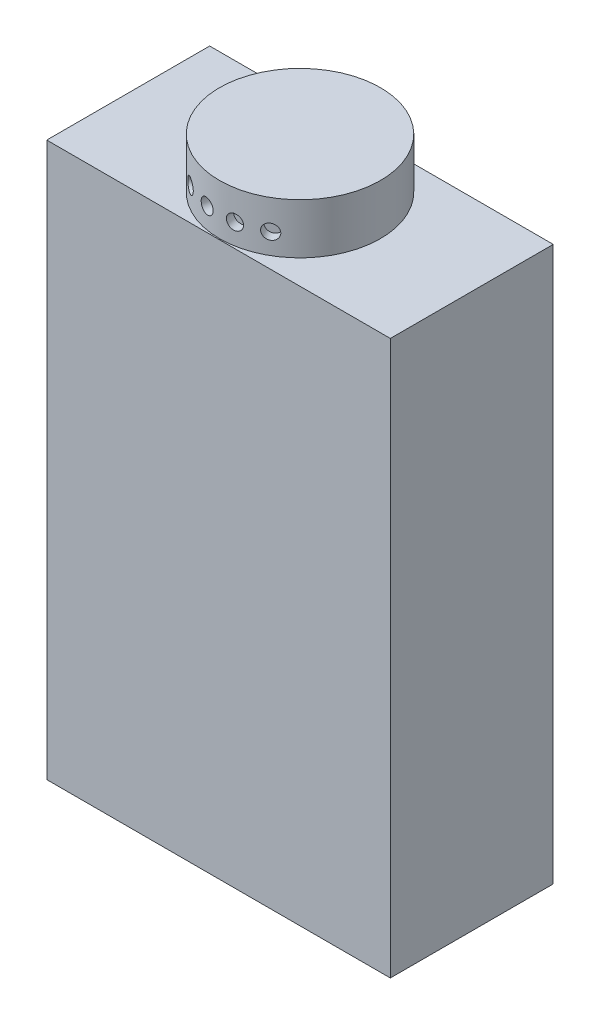
ISO-10303-21;
HEADER;
FILE_DESCRIPTION(('STEP AP214'),'2;1');
FILE_NAME('part.step','',(''),(''),'','','');
FILE_SCHEMA(('AUTOMOTIVE_DESIGN { 1 0 10303 214 1 1 1 1 }'));
ENDSEC;
DATA;
#1=APPLICATION_CONTEXT('core data for automotive mechanical design processes');
#2=APPLICATION_PROTOCOL_DEFINITION('international standard','automotive_design',2000,#1);
#3=PRODUCT_CONTEXT('',#1,'mechanical');
#4=PRODUCT('Part','Part','',(#3));
#5=PRODUCT_RELATED_PRODUCT_CATEGORY('part','',(#4));
#6=PRODUCT_DEFINITION_FORMATION('','',#4);
#7=PRODUCT_DEFINITION_CONTEXT('part definition',#1,'design');
#8=PRODUCT_DEFINITION('design','',#6,#7);
#9=PRODUCT_DEFINITION_SHAPE('','',#8);
#10=(LENGTH_UNIT() NAMED_UNIT(*) SI_UNIT(.MILLI.,.METRE.));
#11=(NAMED_UNIT(*) PLANE_ANGLE_UNIT() SI_UNIT($,.RADIAN.));
#12=(NAMED_UNIT(*) SI_UNIT($,.STERADIAN.) SOLID_ANGLE_UNIT());
#13=UNCERTAINTY_MEASURE_WITH_UNIT(LENGTH_MEASURE(1.E-05),#10,'distance_accuracy_value','');
#14=(GEOMETRIC_REPRESENTATION_CONTEXT(3) GLOBAL_UNCERTAINTY_ASSIGNED_CONTEXT((#13)) GLOBAL_UNIT_ASSIGNED_CONTEXT((#10,
#11,#12)) REPRESENTATION_CONTEXT('',''));
#15=CARTESIAN_POINT('',(0.,0.,0.));
#16=DIRECTION('',(0.,0.,1.));
#17=DIRECTION('',(1.,0.,0.));
#18=AXIS2_PLACEMENT_3D('',#15,#16,#17);
#19=CARTESIAN_POINT('',(58.,187.,27.5));
#20=DIRECTION('',(0.,1.,0.));
#21=DIRECTION('',(0.,0.,1.));
#22=AXIS2_PLACEMENT_3D('',#19,#20,#21);
#23=PLANE('',#22);
#24=DIRECTION('',(0.,0.,-1.));
#25=VECTOR('',#24,1.);
#26=CARTESIAN_POINT('',(58.,187.,-27.5));
#27=LINE('',#26,#25);
#28=CARTESIAN_POINT('',(58.,187.,27.5));
#29=VERTEX_POINT('',#28);
#30=CARTESIAN_POINT('',(58.,187.,-27.5));
#31=VERTEX_POINT('',#30);
#32=EDGE_CURVE('E91',#29,#31,#27,.T.);
#33=ORIENTED_EDGE('',*,*,#32,.T.);
#34=DIRECTION('',(-1.,0.,0.));
#35=VECTOR('',#34,1.);
#36=CARTESIAN_POINT('',(-58.,187.,-27.5));
#37=LINE('',#36,#35);
#38=CARTESIAN_POINT('',(-58.,187.,-27.5));
#39=VERTEX_POINT('',#38);
#40=EDGE_CURVE('E86',#31,#39,#37,.T.);
#41=ORIENTED_EDGE('',*,*,#40,.T.);
#42=DIRECTION('',(0.,0.,1.));
#43=VECTOR('',#42,1.);
#44=CARTESIAN_POINT('',(-58.,187.,-27.5));
#45=LINE('',#44,#43);
#46=CARTESIAN_POINT('',(-58.,187.,27.5));
#47=VERTEX_POINT('',#46);
#48=EDGE_CURVE('E89',#39,#47,#45,.T.);
#49=ORIENTED_EDGE('',*,*,#48,.T.);
#50=DIRECTION('',(1.,0.,0.));
#51=VECTOR('',#50,1.);
#52=CARTESIAN_POINT('',(-58.,187.,27.5));
#53=LINE('',#52,#51);
#54=EDGE_CURVE('E56',#47,#29,#53,.T.);
#55=ORIENTED_EDGE('',*,*,#54,.T.);
#56=EDGE_LOOP('',(#33,#41,#49,#55));
#57=FACE_BOUND('',#56,.T.);
#58=CARTESIAN_POINT('',(0.,187.,0.));
#59=DIRECTION('',(0.,1.,0.));
#60=DIRECTION('',(0.,0.,1.));
#61=AXIS2_PLACEMENT_3D('',#58,#59,#60);
#62=CIRCLE('',#61,27.1639746488095);
#63=CARTESIAN_POINT('',(0.,187.,27.1639746488095));
#64=VERTEX_POINT('',#63);
#65=EDGE_CURVE('E118',#64,#64,#62,.T.);
#66=ORIENTED_EDGE('',*,*,#65,.F.);
#67=EDGE_LOOP('',(#66));
#68=FACE_BOUND('',#67,.T.);
#69=ADVANCED_FACE('F34',(#57,#68),#23,.T.);
#70=CARTESIAN_POINT('',(58.,187.,-27.5));
#71=DIRECTION('',(-1.,0.,0.));
#72=DIRECTION('',(0.,0.,1.));
#73=AXIS2_PLACEMENT_3D('',#70,#71,#72);
#74=PLANE('',#73);
#75=DIRECTION('',(0.,0.,-1.));
#76=VECTOR('',#75,1.);
#77=CARTESIAN_POINT('',(58.,0.,-27.5));
#78=LINE('',#77,#76);
#79=CARTESIAN_POINT('',(58.,0.,27.5));
#80=VERTEX_POINT('',#79);
#81=CARTESIAN_POINT('',(58.,0.,-27.5));
#82=VERTEX_POINT('',#81);
#83=EDGE_CURVE('E104',#80,#82,#78,.T.);
#84=ORIENTED_EDGE('',*,*,#83,.T.);
#85=DIRECTION('',(0.,-1.,0.));
#86=VECTOR('',#85,1.);
#87=CARTESIAN_POINT('',(58.,187.,-27.5));
#88=LINE('',#87,#86);
#89=EDGE_CURVE('E11',#31,#82,#88,.T.);
#90=ORIENTED_EDGE('',*,*,#89,.F.);
#91=ORIENTED_EDGE('',*,*,#32,.F.);
#92=DIRECTION('',(0.,-1.,0.));
#93=VECTOR('',#92,1.);
#94=CARTESIAN_POINT('',(58.,187.,27.5));
#95=LINE('',#94,#93);
#96=EDGE_CURVE('E100',#29,#80,#95,.T.);
#97=ORIENTED_EDGE('',*,*,#96,.T.);
#98=EDGE_LOOP('',(#84,#90,#91,#97));
#99=FACE_BOUND('',#98,.T.);
#100=ADVANCED_FACE('F36',(#99),#74,.F.);
#101=CARTESIAN_POINT('',(-58.,187.,-27.5));
#102=DIRECTION('',(0.,0.,1.));
#103=DIRECTION('',(1.,0.,0.));
#104=AXIS2_PLACEMENT_3D('',#101,#102,#103);
#105=PLANE('',#104);
#106=DIRECTION('',(-1.,0.,0.));
#107=VECTOR('',#106,1.);
#108=CARTESIAN_POINT('',(-58.,0.,-27.5));
#109=LINE('',#108,#107);
#110=CARTESIAN_POINT('',(-58.,0.,-27.5));
#111=VERTEX_POINT('',#110);
#112=EDGE_CURVE('E95',#82,#111,#109,.T.);
#113=ORIENTED_EDGE('',*,*,#112,.T.);
#114=DIRECTION('',(0.,-1.,0.));
#115=VECTOR('',#114,1.);
#116=CARTESIAN_POINT('',(-58.,187.,-27.5));
#117=LINE('',#116,#115);
#118=EDGE_CURVE('E48',#39,#111,#117,.T.);
#119=ORIENTED_EDGE('',*,*,#118,.F.);
#120=ORIENTED_EDGE('',*,*,#40,.F.);
#121=ORIENTED_EDGE('',*,*,#89,.T.);
#122=EDGE_LOOP('',(#113,#119,#120,#121));
#123=FACE_BOUND('',#122,.T.);
#124=ADVANCED_FACE('F94',(#123),#105,.F.);
#125=CARTESIAN_POINT('',(-58.,187.,-27.5));
#126=DIRECTION('',(1.,0.,0.));
#127=DIRECTION('',(0.,0.,-1.));
#128=AXIS2_PLACEMENT_3D('',#125,#126,#127);
#129=PLANE('',#128);
#130=DIRECTION('',(0.,0.,1.));
#131=VECTOR('',#130,1.);
#132=CARTESIAN_POINT('',(-58.,0.,-27.5));
#133=LINE('',#132,#131);
#134=CARTESIAN_POINT('',(-58.,0.,27.5));
#135=VERTEX_POINT('',#134);
#136=EDGE_CURVE('E73',#111,#135,#133,.T.);
#137=ORIENTED_EDGE('',*,*,#136,.T.);
#138=DIRECTION('',(0.,-1.,0.));
#139=VECTOR('',#138,1.);
#140=CARTESIAN_POINT('',(-58.,187.,27.5));
#141=LINE('',#140,#139);
#142=EDGE_CURVE('E96',#47,#135,#141,.T.);
#143=ORIENTED_EDGE('',*,*,#142,.F.);
#144=ORIENTED_EDGE('',*,*,#48,.F.);
#145=ORIENTED_EDGE('',*,*,#118,.T.);
#146=EDGE_LOOP('',(#137,#143,#144,#145));
#147=FACE_BOUND('',#146,.T.);
#148=ADVANCED_FACE('F98',(#147),#129,.F.);
#149=CARTESIAN_POINT('',(-58.,187.,27.5));
#150=DIRECTION('',(0.,0.,-1.));
#151=DIRECTION('',(-1.,0.,0.));
#152=AXIS2_PLACEMENT_3D('',#149,#150,#151);
#153=PLANE('',#152);
#154=DIRECTION('',(1.,0.,0.));
#155=VECTOR('',#154,1.);
#156=CARTESIAN_POINT('',(-58.,0.,27.5));
#157=LINE('',#156,#155);
#158=EDGE_CURVE('E79',#135,#80,#157,.T.);
#159=ORIENTED_EDGE('',*,*,#158,.T.);
#160=ORIENTED_EDGE('',*,*,#96,.F.);
#161=ORIENTED_EDGE('',*,*,#54,.F.);
#162=ORIENTED_EDGE('',*,*,#142,.T.);
#163=EDGE_LOOP('',(#159,#160,#161,#162));
#164=FACE_BOUND('',#163,.T.);
#165=ADVANCED_FACE('F112',(#164),#153,.F.);
#166=CARTESIAN_POINT('',(58.,0.,27.5));
#167=DIRECTION('',(0.,1.,0.));
#168=DIRECTION('',(0.,0.,1.));
#169=AXIS2_PLACEMENT_3D('',#166,#167,#168);
#170=PLANE('',#169);
#171=ORIENTED_EDGE('',*,*,#83,.F.);
#172=ORIENTED_EDGE('',*,*,#158,.F.);
#173=ORIENTED_EDGE('',*,*,#136,.F.);
#174=ORIENTED_EDGE('',*,*,#112,.F.);
#175=EDGE_LOOP('',(#171,#172,#173,#174));
#176=FACE_BOUND('',#175,.T.);
#177=ADVANCED_FACE('F115',(#176),#170,.F.);
#178=CARTESIAN_POINT('',(0.,204.,0.));
#179=DIRECTION('',(0.,-1.,0.));
#180=DIRECTION('',(0.,0.,-1.));
#181=AXIS2_PLACEMENT_3D('',#178,#179,#180);
#182=CYLINDRICAL_SURFACE('',#181,27.1639746488095);
#183=CARTESIAN_POINT('',(-15.6894074743378,194.,22.1748508862035));
#184=CARTESIAN_POINT('',(-15.6894029550685,194.140106679944,22.1748552497607));
#185=CARTESIAN_POINT('',(-15.6797233104639,194.280307372974,22.1817125712672));
#186=CARTESIAN_POINT('',(-15.6412082986541,194.55682562425,22.2088868633514));
#187=CARTESIAN_POINT('',(-15.6123515233179,194.693138665006,22.2292188761488));
#188=CARTESIAN_POINT('',(-15.5361917214486,194.957836922639,22.2825136067384));
#189=CARTESIAN_POINT('',(-15.4888995146054,195.086226738526,22.3154689157656));
#190=CARTESIAN_POINT('',(-15.3770253854371,195.331514670671,22.3927043298646));
#191=CARTESIAN_POINT('',(-15.312447028161,195.448415149669,22.4369820997387));
#192=CARTESIAN_POINT('',(-15.1673632323357,195.667797704017,22.5353120523544));
#193=CARTESIAN_POINT('',(-15.0868144178466,195.770239181979,22.5893908195667));
#194=CARTESIAN_POINT('',(-14.9118873967137,195.957446593354,22.7052442307431));
#195=CARTESIAN_POINT('',(-14.817508572057,196.042211736464,22.7670192186049));
#196=CARTESIAN_POINT('',(-14.6171283072616,196.191798299131,22.8961850780134));
#197=CARTESIAN_POINT('',(-14.5111065857751,196.256584143773,22.963585698529));
#198=CARTESIAN_POINT('',(-14.2903522098092,196.3641455156,23.1016077357295));
#199=CARTESIAN_POINT('',(-14.1756197377129,196.406921503474,23.1722290849674));
#200=CARTESIAN_POINT('',(-13.9408891048282,196.469130815425,23.3141991022032));
#201=CARTESIAN_POINT('',(-13.8209069008981,196.488630387828,23.3855451203361));
#202=CARTESIAN_POINT('',(-13.5787215503573,196.503938238329,23.5269951606814));
#203=CARTESIAN_POINT('',(-13.4565184532482,196.499747043826,23.5970992105075));
#204=CARTESIAN_POINT('',(-13.2137682158334,196.467846309794,23.7338830739325));
#205=CARTESIAN_POINT('',(-13.0932171822919,196.440208008169,23.8005726115568));
#206=CARTESIAN_POINT('',(-12.8569095216933,196.362308483955,23.9290513020504));
#207=CARTESIAN_POINT('',(-12.7411529486769,196.312047006443,23.9908403996916));
#208=CARTESIAN_POINT('',(-12.5177027469731,196.190249116235,24.1081854108323));
#209=CARTESIAN_POINT('',(-12.4100214392579,196.118680989369,24.1637318613998));
#210=CARTESIAN_POINT('',(-12.206164654272,195.956324383044,24.2673475928422));
#211=CARTESIAN_POINT('',(-12.1099894625014,195.865535426815,24.3154166881912));
#212=CARTESIAN_POINT('',(-11.9317707932792,195.666913252932,24.4033665375198));
#213=CARTESIAN_POINT('',(-11.8497810241799,195.559018099299,24.4432162764935));
#214=CARTESIAN_POINT('',(-11.7029613396554,195.329461568824,24.5138506500069));
#215=CARTESIAN_POINT('',(-11.6381314433124,195.207800176674,24.5446352744658));
#216=CARTESIAN_POINT('',(-11.5277166565527,194.954119086872,24.5966870185393));
#217=CARTESIAN_POINT('',(-11.4821349319311,194.822097689516,24.6179525725628));
#218=CARTESIAN_POINT('',(-11.4117393742543,194.55146635191,24.6506641541966));
#219=CARTESIAN_POINT('',(-11.3869250070077,194.412856581228,24.6621104343848));
#220=CARTESIAN_POINT('',(-11.3589469718092,194.133526706341,24.6750092907956));
#221=CARTESIAN_POINT('',(-11.3557043237229,193.992816193052,24.6764983234078));
#222=CARTESIAN_POINT('',(-11.370768631088,193.712801725735,24.669560302936));
#223=CARTESIAN_POINT('',(-11.3890753406109,193.573497755673,24.6611333630163));
#224=CARTESIAN_POINT('',(-11.4465742486166,193.30050129748,24.6344971002037));
#225=CARTESIAN_POINT('',(-11.4857294602349,193.166799322688,24.6163051008235));
#226=CARTESIAN_POINT('',(-11.5836154567347,192.908507788182,24.5703943209817));
#227=CARTESIAN_POINT('',(-11.6423466231619,192.783918406135,24.5426753548342));
#228=CARTESIAN_POINT('',(-11.7776899426034,192.54699306006,24.4780137678918));
#229=CARTESIAN_POINT('',(-11.8543533034462,192.434693565491,24.4410447107215));
#230=CARTESIAN_POINT('',(-12.0230424262827,192.225904971768,24.3585049599857));
#231=CARTESIAN_POINT('',(-12.1150685103831,192.129416204197,24.3129340860653));
#232=CARTESIAN_POINT('',(-12.3119315561214,191.954690816514,24.2138393756627));
#233=CARTESIAN_POINT('',(-12.4168066251542,191.876510594316,24.1602917753055));
#234=CARTESIAN_POINT('',(-12.6359311827317,191.741009073244,24.0464131859454));
#235=CARTESIAN_POINT('',(-12.7501805600529,191.683687526931,23.9860822774215));
#236=CARTESIAN_POINT('',(-12.9844288683476,191.591626716436,23.8600873972671));
#237=CARTESIAN_POINT('',(-13.1044187207573,191.556852983014,23.7944317393884));
#238=CARTESIAN_POINT('',(-13.3467570301701,191.510762319505,23.6593497356381));
#239=CARTESIAN_POINT('',(-13.4691054316638,191.499444838044,23.5899234784393));
#240=CARTESIAN_POINT('',(-13.7121630278396,191.500595020854,23.449471926624));
#241=CARTESIAN_POINT('',(-13.8328766086472,191.512974963781,23.3784534874156));
#242=CARTESIAN_POINT('',(-14.0697426223581,191.560985136124,23.2366719005423));
#243=CARTESIAN_POINT('',(-14.1858950502762,191.596615390952,23.1659087531565));
#244=CARTESIAN_POINT('',(-14.410477978458,191.690091447462,23.0268777452071));
#245=CARTESIAN_POINT('',(-14.5189092021677,191.747935164576,22.9586096511594));
#246=CARTESIAN_POINT('',(-14.7252247178375,191.884186543593,22.8268324255793));
#247=CARTESIAN_POINT('',(-14.8231091238058,191.962593983177,22.7633232426067));
#248=CARTESIAN_POINT('',(-15.0061819349326,192.138076497126,22.6430581384714));
#249=CARTESIAN_POINT('',(-15.0913241145483,192.235216746818,22.5863269493437));
#250=CARTESIAN_POINT('',(-15.2463998957924,192.445283258154,22.4819387902088));
#251=CARTESIAN_POINT('',(-15.3163298266146,192.558213319198,22.4342840107379));
#252=CARTESIAN_POINT('',(-15.4393784717859,192.796919898152,22.3497810354003));
#253=CARTESIAN_POINT('',(-15.4924597954822,192.922724180389,22.3129568881142));
#254=CARTESIAN_POINT('',(-15.5802565800934,193.183323685357,22.2517418321618));
#255=CARTESIAN_POINT('',(-15.6149929573231,193.318108470402,22.2273367648246));
#256=CARTESIAN_POINT('',(-15.6565236988368,193.544727263779,22.1980891053294));
#257=CARTESIAN_POINT('',(-15.6688407826757,193.635107968525,22.1893904836404));
#258=CARTESIAN_POINT('',(-15.6852841326434,193.81697907676,22.1777699586016));
#259=CARTESIAN_POINT('',(-15.6894104267386,193.908469476459,22.174848035528));
#260=CARTESIAN_POINT('',(-15.6894074743378,194.,22.1748508862035));
#261=B_SPLINE_CURVE_WITH_KNOTS('',3,(#183,#184,#185,#186,#187,#188,#189,#190,#191,#192,#193,
#194,#195,#196,#197,#198,#199,#200,#201,#202,#203,#204,#205,#206,#207,#208,#209,#210,#211,#212,
#213,#214,#215,#216,#217,#218,#219,#220,#221,#222,#223,#224,#225,#226,#227,#228,#229,#230,#231,
#232,#233,#234,#235,#236,#237,#238,#239,#240,#241,#242,#243,#244,#245,#246,#247,#248,#249,#250,
#251,#252,#253,#254,#255,#256,#257,#258,#259,#260),.UNSPECIFIED.,.T.,.F.,(4,2,2,2,2,2,2,2,2,2,2,
2,2,2,2,2,2,2,2,2,2,2,2,2,2,2,2,2,2,2,2,2,2,2,2,2,2,2,4),(0.,0.419985816117514,
0.840441267072524,1.2606503248227,1.68077278647306,2.10205233428176,2.52335071328604,
2.94539497694104,3.3674304063887,3.78826177083129,4.20908376684071,4.62863176537844,
5.04818449156041,5.46836485576642,5.88855564369877,6.31030409197152,6.73205300923913,
7.15387126562081,7.57567867138784,7.99594086752037,8.41619826752923,8.83571257028185,
9.25523505006724,9.67597048328867,10.0967147390801,10.5187384968377,10.9407572481225,
11.3621293212808,11.783491489359,12.2032969064921,12.6231027824565,13.0428692723797,
13.4626312242855,13.8838808593904,14.3052320320604,14.7275118390617,15.1493091311115,
15.4236832929897,15.6980565180519),.UNSPECIFIED.);
#262=CARTESIAN_POINT('',(-15.6894074743378,194.,22.1748508862035));
#263=VERTEX_POINT('',#262);
#264=EDGE_CURVE('E163',#263,#263,#261,.T.);
#265=ORIENTED_EDGE('',*,*,#264,.T.);
#266=EDGE_LOOP('',(#265));
#267=FACE_BOUND('',#266,.T.);
#268=CARTESIAN_POINT('',(-7.15897474981381,194.,26.2036371378611));
#269=CARTESIAN_POINT('',(-7.1589690106654,194.140106679944,26.2036396925825));
#270=CARTESIAN_POINT('',(-7.14752777797415,194.280307372974,26.2067728335655));
#271=CARTESIAN_POINT('',(-7.10204135031359,194.55682562425,26.2191354054527));
#272=CARTESIAN_POINT('',(-7.06797089353938,194.693138665006,26.2283716494078));
#273=CARTESIAN_POINT('',(-6.97817621832752,194.957836922639,26.2524041281186));
#274=CARTESIAN_POINT('',(-6.92246470101946,195.086226738526,26.2671971014644));
#275=CARTESIAN_POINT('',(-6.79092133998319,195.331514670671,26.3015114444641));
#276=CARTESIAN_POINT('',(-6.71509364498992,195.448415149669,26.3210318390683));
#277=CARTESIAN_POINT('',(-6.54512864817042,195.667797704017,26.3638101893012));
#278=CARTESIAN_POINT('',(-6.45094149386912,195.770239181979,26.3870782907154));
#279=CARTESIAN_POINT('',(-6.24693966263913,195.957446593354,26.4361163214513));
#280=CARTESIAN_POINT('',(-6.13712428734839,196.042211736464,26.4618863625582));
#281=CARTESIAN_POINT('',(-5.90465110542129,196.191798299131,26.514728480617));
#282=CARTESIAN_POINT('',(-5.78197090620849,196.256584143773,26.5418027819734));
#283=CARTESIAN_POINT('',(-5.52732333116167,196.3641455156,26.5959986285289));
#284=CARTESIAN_POINT('',(-5.39535614978008,196.406921503474,26.6231201727272));
#285=CARTESIAN_POINT('',(-5.12622490054304,196.469130815425,26.6762457455944));
#286=CARTESIAN_POINT('',(-4.9890767335367,196.488630387828,26.7022527417716));
#287=CARTESIAN_POINT('',(-4.71311818369875,196.503938238329,26.7523400325906));
#288=CARTESIAN_POINT('',(-4.5743078379389,196.499747043826,26.7764203701113));
#289=CARTESIAN_POINT('',(-4.29941439457297,196.467846309794,26.8219296862215));
#290=CARTESIAN_POINT('',(-4.16332431270926,196.440208008169,26.8433664708407));
#291=CARTESIAN_POINT('',(-3.89732544767265,196.362308483955,26.8832749682789));
#292=CARTESIAN_POINT('',(-3.76741673417051,196.312047006443,26.9017466476834));
#293=CARTESIAN_POINT('',(-3.5173078709875,196.190249116235,26.9355904187254));
#294=CARTESIAN_POINT('',(-3.39712253574651,196.118680989369,26.9509578321363));
#295=CARTESIAN_POINT('',(-3.17012115187946,195.956324383044,26.9786016435514));
#296=CARTESIAN_POINT('',(-3.06330543498918,195.865535426815,26.9908779648649));
#297=CARTESIAN_POINT('',(-2.8657540465619,195.666913252932,27.0125694144875));
#298=CARTESIAN_POINT('',(-2.77507945212405,195.559018099299,27.0219737675628));
#299=CARTESIAN_POINT('',(-2.61295569943749,195.329461568824,27.038133077583));
#300=CARTESIAN_POINT('',(-2.54150656256806,195.207800176674,27.0448880315817));
#301=CARTESIAN_POINT('',(-2.41994785725594,194.954119086872,27.0560365901938));
#302=CARTESIAN_POINT('',(-2.36984179915133,194.822097689516,27.0604298063985));
#303=CARTESIAN_POINT('',(-2.29250359322751,194.55146635191,27.0670919395479));
#304=CARTESIAN_POINT('',(-2.26527085704591,194.412856581228,27.069360911134));
#305=CARTESIAN_POINT('',(-2.23456843510736,194.133526706341,27.0719128197112));
#306=CARTESIAN_POINT('',(-2.23101206348148,193.992816193052,27.0722030017058));
#307=CARTESIAN_POINT('',(-2.24754082470584,193.712801725735,27.0708356916297));
#308=CARTESIAN_POINT('',(-2.26762568775455,193.573497755673,27.0691782217862));
#309=CARTESIAN_POINT('',(-2.33076712573558,193.30050129748,27.063814106933));
#310=CARTESIAN_POINT('',(-2.373783019394,193.166799322688,27.0601110904477));
#311=CARTESIAN_POINT('',(-2.48146817948483,192.908507788182,27.0504480519683));
#312=CARTESIAN_POINT('',(-2.54613786796123,192.783918406135,27.0444879859828));
#313=CARTESIAN_POINT('',(-2.69543455174672,192.54699306006,27.0300161113983));
#314=CARTESIAN_POINT('',(-2.78011870844738,192.434693565491,27.0214969748413));
#315=CARTESIAN_POINT('',(-2.96686488976045,192.225904971768,27.0016300581234));
#316=CARTESIAN_POINT('',(-3.06892727873911,192.129416204197,26.9902822186513));
#317=CARTESIAN_POINT('',(-3.28781041717955,191.954690816514,26.964494777646));
#318=CARTESIAN_POINT('',(-3.40467510360298,191.876510594316,26.9500458788714));
#319=CARTESIAN_POINT('',(-3.64953360484626,191.741009073244,26.917980021373));
#320=CARTESIAN_POINT('',(-3.77752728762468,191.683687526931,26.9003631002341));
#321=CARTESIAN_POINT('',(-4.04074148132949,191.591626716436,26.8620842810729));
#322=CARTESIAN_POINT('',(-4.1759506177259,191.556852983014,26.8414270903703));
#323=CARTESIAN_POINT('',(-4.44987490509822,191.510762319505,26.7973761115638));
#324=CARTESIAN_POINT('',(-4.58858997358447,191.499444838044,26.7739823877999));
#325=CARTESIAN_POINT('',(-4.86502666301902,191.500595020854,26.7251316948616));
#326=CARTESIAN_POINT('',(-5.00275006088934,191.512974963781,26.6996826678069));
#327=CARTESIAN_POINT('',(-5.27382346475186,191.560985136124,26.6474645048171));
#328=CARTESIAN_POINT('',(-5.40717346596395,191.596615390952,26.6206953674393));
#329=CARTESIAN_POINT('',(-5.66576379159638,191.690091447462,26.566860840494));
#330=CARTESIAN_POINT('',(-5.79100487569001,191.747935164576,26.5397954789564));
#331=CARTESIAN_POINT('',(-6.02994850889849,191.884186543593,26.4865294547309));
#332=CARTESIAN_POINT('',(-6.14365118273965,191.962593983177,26.460328782698));
#333=CARTESIAN_POINT('',(-6.35681644057551,192.138076497126,26.4099311409046));
#334=CARTESIAN_POINT('',(-6.45622712791448,192.235216746818,26.385741601588));
#335=CARTESIAN_POINT('',(-6.63765354836101,192.445283258154,26.340687859679));
#336=CARTESIAN_POINT('',(-6.71966508283151,192.558213319198,26.3198244600276));
#337=CARTESIAN_POINT('',(-6.86419470643308,192.796919898152,26.282502752926));
#338=CARTESIAN_POINT('',(-6.92666943474468,192.922724180389,26.266054255393));
#339=CARTESIAN_POINT('',(-7.03010820758306,193.183323685357,26.2385591878897));
#340=CARTESIAN_POINT('',(-7.07109674956725,193.318108470402,26.227506466922));
#341=CARTESIAN_POINT('',(-7.12012616959595,193.544727263779,26.214227007284));
#342=CARTESIAN_POINT('',(-7.13467554622571,193.635107968525,26.2102656674517));
#343=CARTESIAN_POINT('',(-7.15410169449064,193.81697907676,26.2049699027358));
#344=CARTESIAN_POINT('',(-7.15897849915152,193.908469476459,26.2036354688829));
#345=CARTESIAN_POINT('',(-7.15897474981381,194.,26.2036371378611));
#346=B_SPLINE_CURVE_WITH_KNOTS('',3,(#268,#269,#270,#271,#272,#273,#274,#275,#276,#277,#278,
#279,#280,#281,#282,#283,#284,#285,#286,#287,#288,#289,#290,#291,#292,#293,#294,#295,#296,#297,
#298,#299,#300,#301,#302,#303,#304,#305,#306,#307,#308,#309,#310,#311,#312,#313,#314,#315,#316,
#317,#318,#319,#320,#321,#322,#323,#324,#325,#326,#327,#328,#329,#330,#331,#332,#333,#334,#335,
#336,#337,#338,#339,#340,#341,#342,#343,#344,#345),.UNSPECIFIED.,.T.,.F.,(4,2,2,2,2,2,2,2,2,2,2,
2,2,2,2,2,2,2,2,2,2,2,2,2,2,2,2,2,2,2,2,2,2,2,2,2,2,2,4),(0.,0.419985816117514,
0.840441267072525,1.26065032482272,1.68077278647306,2.10205233428176,2.52335071328604,
2.94539497694106,3.3674304063887,3.78826177083129,4.20908376684072,4.62863176537845,
5.04818449156042,5.4683648557664,5.88855564369878,6.31030409197153,6.73205300923914,
7.15387126562081,7.57567867138785,7.99594086752038,8.41619826752923,8.83571257028186,
9.25523505006725,9.67597048328868,10.0967147390801,10.5187384968377,10.9407572481225,
11.3621293212808,11.783491489359,12.2032969064921,12.6231027824565,13.0428692723797,
13.4626312242855,13.8838808593904,14.3052320320604,14.7275118390617,15.1493091311116,
15.4236832929897,15.6980565180519),.UNSPECIFIED.);
#347=CARTESIAN_POINT('',(-7.15897474981381,194.,26.2036371378611));
#348=VERTEX_POINT('',#347);
#349=EDGE_CURVE('E155',#348,#348,#346,.T.);
#350=ORIENTED_EDGE('',*,*,#349,.T.);
#351=EDGE_LOOP('',(#350));
#352=FACE_BOUND('',#351,.T.);
#353=CARTESIAN_POINT('',(2.23493598475241,194.,27.0718780261958));
#354=CARTESIAN_POINT('',(2.234942251554,194.140106679944,27.0718784639443));
#355=CARTESIAN_POINT('',(2.24676509081473,194.280307372974,27.070909521361));
#356=CARTESIAN_POINT('',(2.293736599842,194.55682562425,27.0669692644295));
#357=CARTESIAN_POINT('',(2.32891133814084,194.693138665006,27.0639957122088));
#358=CARTESIAN_POINT('',(2.42151032363644,194.957836922639,27.0558672674267));
#359=CARTESIAN_POINT('',(2.47892152020756,195.086226738526,27.0507136541847));
#360=CARTESIAN_POINT('',(2.61426804239759,195.331514670671,27.0379681098934));
#361=CARTESIAN_POINT('',(2.69219913599428,195.448415149669,27.0303766815482));
#362=CARTESIAN_POINT('',(2.86654504677533,195.667797704017,27.0124437290188));
#363=CARTESIAN_POINT('',(2.96301018002571,195.770239181979,27.0020946882039));
#364=CARTESIAN_POINT('',(3.17148118976005,195.957446593354,26.9784026282684));
#365=CARTESIAN_POINT('',(3.28348776072248,196.042211736464,26.9650594753375));
#366=CARTESIAN_POINT('',(3.52001416310208,196.191798299131,26.935204312742));
#367=CARTESIAN_POINT('',(3.64455579744926,196.256584143773,26.9186867346216));
#368=CARTESIAN_POINT('',(3.90238231582835,196.3641455156,26.882519571592));
#369=CARTESIAN_POINT('',(4.03566701679247,196.406921503474,26.862870052249));
#370=CARTESIAN_POINT('',(4.30673768176971,196.469130815425,26.8207434526099));
#371=CARTESIAN_POINT('',(4.44450971881987,196.488630387828,26.79827459927));
#372=CARTESIAN_POINT('',(4.7209567941301,196.503938238329,26.7509578740803));
#373=CARTESIAN_POINT('',(4.85963181221953,196.499747043826,26.7261100552027));
#374=CARTESIAN_POINT('',(5.13351225527156,196.467846309794,26.6748557288291));
#375=CARTESIAN_POINT('',(5.26872691310895,196.440208008169,26.648454167845));
#376=CARTESIAN_POINT('',(5.53233359373501,196.362308483955,26.59497891845));
#377=CARTESIAN_POINT('',(5.66072553962616,196.312047006443,26.5679052224687));
#378=CARTESIAN_POINT('',(5.90732624417486,196.190249116235,26.5141656951435));
#379=CARTESIAN_POINT('',(6.02551948176484,196.118680989369,26.4875005345416));
#380=CARTESIAN_POINT('',(6.24828574743513,195.956324383044,26.4358381742933));
#381=CARTESIAN_POINT('',(6.35285843755605,195.865535426815,26.4108410160418));
#382=CARTESIAN_POINT('',(6.54591493219603,195.666913252932,26.3636577570022));
#383=CARTESIAN_POINT('',(6.63433765766871,195.559018099299,26.3414824204047));
#384=CARTESIAN_POINT('',(6.79221096125155,195.329461568824,26.3012176156573));
#385=CARTESIAN_POINT('',(6.86166151826409,195.207800176674,26.2831281520511));
#386=CARTESIAN_POINT('',(6.97970236825256,194.954119086872,26.2520288444979));
#387=CARTESIAN_POINT('',(7.02828922974614,194.822097689516,26.2390198361726));
#388=CARTESIAN_POINT('',(7.10324195489219,194.55146635191,26.2188289692572));
#389=CARTESIAN_POINT('',(7.12960839011291,194.412856581228,26.2116469607814));
#390=CARTESIAN_POINT('',(7.15933203358615,194.133526706341,26.2035441236885));
#391=CARTESIAN_POINT('',(7.16277317784714,193.992816193052,26.2026004548343));
#392=CARTESIAN_POINT('',(7.14677357530568,193.712801725735,26.2069687729284));
#393=CARTESIAN_POINT('',(7.12733308963589,193.573497755673,26.2122806884859));
#394=CARTESIAN_POINT('',(7.0661649109684,193.30050129748,26.2288357130093));
#395=CARTESIAN_POINT('',(7.02447668689205,193.166799322688,26.2400683178578));
#396=CARTESIAN_POINT('',(6.91998078278085,192.908507788182,26.2678185257927));
#397=CARTESIAN_POINT('',(6.85717269110845,192.783918406135,26.2843362318882));
#398=CARTESIAN_POINT('',(6.71193002642783,192.54699306006,26.3217995913186));
#399=CARTESIAN_POINT('',(6.62943923297249,192.434693565491,26.3427579089726));
#400=CARTESIAN_POINT('',(6.44716033872936,192.225904971768,26.3879600696333));
#401=CARTESIAN_POINT('',(6.34737187526366,192.129416204197,26.4122039815261));
#402=CARTESIAN_POINT('',(6.13286918098809,191.954690816514,26.4628341558855));
#403=CARTESIAN_POINT('',(6.01811048309573,191.876510594316,26.4892267091287));
#404=CARTESIAN_POINT('',(5.77705158716327,191.741009073244,26.5428411991481));
#405=CARTESIAN_POINT('',(5.65075152605629,191.683687526931,26.5700631260815));
#406=CARTESIAN_POINT('',(5.39031896332992,191.591626716436,26.6241173584396));
#407=CARTESIAN_POINT('',(5.25619876027057,191.556852983014,26.6509501969795));
#408=CARTESIAN_POINT('',(4.98372780668774,191.510762319505,26.7032434412841));
#409=CARTESIAN_POINT('',(4.84537715568472,191.499444838044,26.7287038792955));
#410=CARTESIAN_POINT('',(4.56890371750828,191.500595020854,26.777346159762));
#411=CARTESIAN_POINT('',(4.43078197693923,191.512974963781,26.8005360731114));
#412=CARTESIAN_POINT('',(4.15819663604834,191.560985136124,26.8441796151198));
#413=CARTESIAN_POINT('',(4.02373303972488,191.596615390952,26.864633240788));
#414=CARTESIAN_POINT('',(3.76232512629975,191.690091447462,26.9024884333095));
#415=CARTESIAN_POINT('',(3.6353801049255,191.747935164576,26.9198902863257));
#416=CARTESIAN_POINT('',(3.39262848277571,191.884186543593,26.9515601320991));
#417=CARTESIAN_POINT('',(3.27682176159963,191.962593983177,26.9658281587338));
#418=CARTESIAN_POINT('',(3.05927493313391,192.138076497126,26.9913766786726));
#419=CARTESIAN_POINT('',(2.95758613411019,192.235216746818,27.0026464046084));
#420=CARTESIAN_POINT('',(2.77169177833591,192.445283258154,27.0223612261219));
#421=CARTESIAN_POINT('',(2.68749044163561,192.558213319198,27.0308056401989));
#422=CARTESIAN_POINT('',(2.53891224524019,192.796919898152,27.0451667500194));
#423=CARTESIAN_POINT('',(2.47457948657644,192.922724180389,27.051077833796));
#424=CARTESIAN_POINT('',(2.36797496810886,193.183323685357,27.0606190656668));
#425=CARTESIAN_POINT('',(2.32567808446001,193.318108470402,27.0642518123379));
#426=CARTESIAN_POINT('',(2.27506365756896,193.544727263779,27.0685422513735));
#427=CARTESIAN_POINT('',(2.26003685769574,193.635107968525,27.0697959894449));
#428=CARTESIAN_POINT('',(2.23997099131374,193.81697907676,27.0714637324338));
#429=CARTESIAN_POINT('',(2.23493189070328,193.908469476459,27.0718777402184));
#430=CARTESIAN_POINT('',(2.23493598475241,194.,27.0718780261958));
#431=B_SPLINE_CURVE_WITH_KNOTS('',3,(#353,#354,#355,#356,#357,#358,#359,#360,#361,#362,#363,
#364,#365,#366,#367,#368,#369,#370,#371,#372,#373,#374,#375,#376,#377,#378,#379,#380,#381,#382,
#383,#384,#385,#386,#387,#388,#389,#390,#391,#392,#393,#394,#395,#396,#397,#398,#399,#400,#401,
#402,#403,#404,#405,#406,#407,#408,#409,#410,#411,#412,#413,#414,#415,#416,#417,#418,#419,#420,
#421,#422,#423,#424,#425,#426,#427,#428,#429,#430),.UNSPECIFIED.,.T.,.F.,(4,2,2,2,2,2,2,2,2,2,2,
2,2,2,2,2,2,2,2,2,2,2,2,2,2,2,2,2,2,2,2,2,2,2,2,2,2,2,4),(0.,0.419985816117514,
0.840441267072525,1.26065032482272,1.68077278647306,2.10205233428176,2.52335071328604,
2.94539497694106,3.3674304063887,3.7882617708313,4.20908376684072,4.62863176537845,
5.04818449156042,5.46836485576643,5.88855564369878,6.31030409197152,6.73205300923914,
7.15387126562081,7.57567867138784,7.99594086752035,8.41619826752923,8.83571257028185,
9.25523505006725,9.67597048328868,10.0967147390801,10.5187384968377,10.9407572481225,
11.3621293212808,11.783491489359,12.2032969064921,12.6231027824565,13.0428692723796,
13.4626312242855,13.8838808593904,14.3052320320604,14.7275118390617,15.1493091311115,
15.4236832929897,15.6980565180519),.UNSPECIFIED.);
#432=CARTESIAN_POINT('',(2.23493598475241,194.,27.0718780261958));
#433=VERTEX_POINT('',#432);
#434=EDGE_CURVE('E129',#433,#433,#431,.T.);
#435=ORIENTED_EDGE('',*,*,#434,.T.);
#436=EDGE_LOOP('',(#435));
#437=FACE_BOUND('',#436,.T.);
#438=CARTESIAN_POINT('',(11.3592804554153,194.,24.6748508862037));
#439=CARTESIAN_POINT('',(11.3592864940013,194.140106679944,24.6748491541803));
#440=CARTESIAN_POINT('',(11.3700649309301,194.280307372974,24.6698949968064));
#441=CARTESIAN_POINT('',(11.4128560641098,194.55682562425,24.6501271641941));
#442=CARTESIAN_POINT('',(11.4448924913705,194.693138665006,24.6353024700804));
#443=CARTESIAN_POINT('',(11.5291269828836,194.957836922639,24.5959935122092));
#444=CARTESIAN_POINT('',(11.5813132211123,195.086226738526,24.5715149141955));
#445=CARTESIAN_POINT('',(11.7041381163781,195.331514670671,24.513246783359));
#446=CARTESIAN_POINT('',(11.77477296855,195.448415149669,24.4794591703603));
#447=CARTESIAN_POINT('',(11.9324711033808,195.667797704017,24.402977893806));
#448=CARTESIAN_POINT('',(12.0195790968365,195.770239181979,24.3602599578198));
#449=CARTESIAN_POINT('',(12.2073746045968,195.957446593354,24.2666954192985));
#450=CARTESIAN_POINT('',(12.3080627257319,196.042211736464,24.2158484534974));
#451=CARTESIAN_POINT('',(12.5201137736791,196.191798299131,24.1068969834718));
#452=CARTESIAN_POINT('',(12.6314952840196,196.256584143773,24.0487797895694));
#453=CARTESIAN_POINT('',(12.8614030625003,196.3641455156,23.9266119105865));
#454=CARTESIAN_POINT('',(12.979929181038,196.406921503474,23.8625613497311));
#455=CARTESIAN_POINT('',(13.2202441389822,196.469130815425,23.7302636672245));
#456=CARTESIAN_POINT('',(13.3420227051093,196.488630387828,23.6620290396854));
#457=CARTESIAN_POINT('',(13.5856147086851,196.503938238329,23.5230153938653));
#458=CARTESIAN_POINT('',(13.7074281452972,196.499747043826,23.4522364322607));
#459=CARTESIAN_POINT('',(13.9472615645584,196.467846309794,23.3104004915973));
#460=CARTESIAN_POINT('',(14.0652919150785,196.440208008169,23.23934500291));
#461=CARTESIAN_POINT('',(14.2947115551902,196.362308483955,23.0989359109696));
#462=CARTESIAN_POINT('',(14.4061007699326,196.312047006443,23.029582326903));
#463=CARTESIAN_POINT('',(14.6194496314396,196.190249116235,22.8947412813171));
#464=CARTESIAN_POINT('',(14.7213949225788,196.118680989369,22.8292597586067));
#465=CARTESIAN_POINT('',(14.9130571707326,195.956324383044,22.7045224697964));
#466=CARTESIAN_POINT('',(15.002773824327,195.865535426815,22.6452668581837));
#467=CARTESIAN_POINT('',(15.1680499627157,195.666913252932,22.5348998878728));
#468=CARTESIAN_POINT('',(15.2435557335508,195.559018099299,22.4838195344693));
#469=CARTESIAN_POINT('',(15.378136737656,195.329461568824,22.3919871446521));
#470=CARTESIAN_POINT('',(15.4372119526549,195.207800176674,22.3512351197239));
#471=CARTESIAN_POINT('',(15.5374974787137,194.954119086872,22.2816389814733));
#472=CARTESIAN_POINT('',(15.5787048510344,194.822097689516,22.2527968270145));
#473=CARTESIAN_POINT('',(15.6422316905656,194.55146635191,22.2081882765697));
#474=CARTESIAN_POINT('',(15.6645516436107,194.412856581228,22.1924215442493));
#475=CARTESIAN_POINT('',(15.6897113985415,194.133526706341,22.1746412832248));
#476=CARTESIAN_POINT('',(15.6926222626539,193.992816193052,22.1725775839127));
#477=CARTESIAN_POINT('',(15.6790816069908,193.712801725735,22.1821546465454));
#478=CARTESIAN_POINT('',(15.6626303081827,193.573497755673,22.1937952520921));
#479=CARTESIAN_POINT('',(15.6108131739222,193.30050129748,22.2302726357085));
#480=CARTESIAN_POINT('',(15.5754808345042,193.166799322688,22.2550860439705));
#481=CARTESIAN_POINT('',(15.4867779346037,192.908507788182,22.3169024136932));
#482=CARTESIAN_POINT('',(15.4334070225397,192.783918406135,22.3539056127392));
#483=CARTESIAN_POINT('',(15.3097367858779,192.54699306006,22.4387855721369));
#484=CARTESIAN_POINT('',(15.2393889627931,192.434693565491,22.4866934615811));
#485=CARTESIAN_POINT('',(15.0835628804156,192.225904971768,22.5915126519318));
#486=CARTESIAN_POINT('',(14.9980843038777,192.129416204197,22.6484241416133));
#487=CARTESIAN_POINT('',(14.8138342444192,191.954690816514,22.7693651850878));
#488=CARTESIAN_POINT('',(14.7150231276817,191.876510594316,22.8334158589151));
#489=CARTESIAN_POINT('',(14.50683909756,191.741009073244,22.9662439976903));
#490=CARTESIAN_POINT('',(14.3974663094843,191.683687526931,23.035021406555));
#491=CARTESIAN_POINT('',(14.1712273883764,191.591626716436,23.1748889522546));
#492=CARTESIAN_POINT('',(14.0543729945465,191.556852983014,23.2459753836984));
#493=CARTESIAN_POINT('',(13.8162193929982,191.510762319505,23.3883055140849));
#494=CARTESIAN_POINT('',(13.6949202898276,191.499444838044,23.4595492092914));
#495=CARTESIAN_POINT('',(13.4517568798667,191.500595020854,23.5998174862548));
#496=CARTESIAN_POINT('',(13.3298963169713,191.512974963781,23.6688492942118));
#497=CARTESIAN_POINT('',(13.0886768540947,191.560985136124,23.803090485942));
#498=CARTESIAN_POINT('',(12.9693179568478,191.596615390952,23.8682998655374));
#499=CARTESIAN_POINT('',(12.736622107959,191.690091447462,23.9932788826243));
#500=CARTESIAN_POINT('',(12.6232845923908,191.747935164576,24.0530490298966));
#501=CARTESIAN_POINT('',(12.4060044095634,191.884186543593,24.1658348948715));
#502=CARTESIAN_POINT('',(12.3020616407514,191.962593983177,24.218850685588));
#503=CARTESIAN_POINT('',(12.106372599818,192.138076497126,24.3172638386984));
#504=CARTESIAN_POINT('',(12.0146708590386,192.235216746818,24.3626335346153));
#505=CARTESIAN_POINT('',(11.8467301707515,192.445283258154,24.444739021117));
#506=CARTESIAN_POINT('',(11.7704949557068,192.558213319198,24.4814727279585));
#507=CARTESIAN_POINT('',(11.6357889097835,192.796919898152,24.5457844929093));
#508=CARTESIAN_POINT('',(11.5773576009128,192.922724180389,24.5733421940537));
#509=CARTESIAN_POINT('',(11.4804454150584,193.183323685357,24.6187689119214));
#510=CARTESIAN_POINT('',(11.4419418181484,193.318108470402,24.6366489633692));
#511=CARTESIAN_POINT('',(11.3958472312674,193.544727263779,24.6579918108105));
#512=CARTESIAN_POINT('',(11.3821554619874,193.635107968525,24.6643094074709));
#513=CARTESIAN_POINT('',(11.3638701171147,193.81697907676,24.6727395037469));
#514=CARTESIAN_POINT('',(11.3592765104575,193.908469476459,24.67485201772));
#515=CARTESIAN_POINT('',(11.3592804554153,194.,24.6748508862037));
#516=B_SPLINE_CURVE_WITH_KNOTS('',3,(#438,#439,#440,#441,#442,#443,#444,#445,#446,#447,#448,
#449,#450,#451,#452,#453,#454,#455,#456,#457,#458,#459,#460,#461,#462,#463,#464,#465,#466,#467,
#468,#469,#470,#471,#472,#473,#474,#475,#476,#477,#478,#479,#480,#481,#482,#483,#484,#485,#486,
#487,#488,#489,#490,#491,#492,#493,#494,#495,#496,#497,#498,#499,#500,#501,#502,#503,#504,#505,
#506,#507,#508,#509,#510,#511,#512,#513,#514,#515),.UNSPECIFIED.,.T.,.F.,(4,2,2,2,2,2,2,2,2,2,2,
2,2,2,2,2,2,2,2,2,2,2,2,2,2,2,2,2,2,2,2,2,2,2,2,2,2,2,4),(0.,0.419985816117514,
0.840441267072525,1.26065032482272,1.68077278647306,2.10205233428176,2.52335071328604,
2.94539497694104,3.3674304063887,3.78826177083129,4.20908376684071,4.62863176537844,
5.04818449156041,5.4683648557664,5.88855564369878,6.31030409197152,6.73205300923914,
7.15387126562081,7.57567867138784,7.99594086752034,8.41619826752923,8.83571257028185,
9.25523505006725,9.67597048328867,10.0967147390801,10.5187384968377,10.9407572481225,
11.3621293212808,11.783491489359,12.2032969064921,12.6231027824565,13.0428692723796,
13.4626312242855,13.8838808593904,14.3052320320604,14.7275118390617,15.1493091311115,
15.4236832929897,15.6980565180519),.UNSPECIFIED.);
#517=CARTESIAN_POINT('',(11.3592804554153,194.,24.6748508862037));
#518=VERTEX_POINT('',#517);
#519=EDGE_CURVE('E38',#518,#518,#516,.T.);
#520=ORIENTED_EDGE('',*,*,#519,.T.);
#521=EDGE_LOOP('',(#520));
#522=FACE_BOUND('',#521,.T.);
#523=CARTESIAN_POINT('',(0.,204.,0.));
#524=DIRECTION('',(0.,1.,0.));
#525=DIRECTION('',(0.,0.,1.));
#526=AXIS2_PLACEMENT_3D('',#523,#524,#525);
#527=CIRCLE('',#526,27.1639746488095);
#528=CARTESIAN_POINT('',(0.,204.,27.1639746488095));
#529=VERTEX_POINT('',#528);
#530=EDGE_CURVE('E107',#529,#529,#527,.T.);
#531=ORIENTED_EDGE('',*,*,#530,.F.);
#532=EDGE_LOOP('',(#531));
#533=FACE_BOUND('',#532,.T.);
#534=ORIENTED_EDGE('',*,*,#65,.T.);
#535=EDGE_LOOP('',(#534));
#536=FACE_BOUND('',#535,.T.);
#537=ADVANCED_FACE('F188',(#267,#352,#437,#522,#533,#536),#182,.T.);
#538=CARTESIAN_POINT('',(0.,204.,0.));
#539=DIRECTION('',(0.,1.,0.));
#540=DIRECTION('',(0.,0.,1.));
#541=AXIS2_PLACEMENT_3D('',#538,#539,#540);
#542=PLANE('',#541);
#543=ORIENTED_EDGE('',*,*,#530,.T.);
#544=EDGE_LOOP('',(#543));
#545=FACE_BOUND('',#544,.T.);
#546=ADVANCED_FACE('F220',(#545),#542,.T.);
#547=CARTESIAN_POINT('',(0.,194.,0.));
#548=DIRECTION('',(-0.499999999999995,0.,-0.866025403784441));
#549=DIRECTION('',(-0.866025403784441,0.,0.499999999999995));
#550=AXIS2_PLACEMENT_3D('',#547,#548,#549);
#551=CYLINDRICAL_SURFACE('',#550,2.5);
#552=CARTESIAN_POINT('',(12.0268992186957,194.,20.8312005042916));
#553=DIRECTION('',(-0.499999999999995,0.,-0.866025403784441));
#554=DIRECTION('',(-0.866025403784441,0.,0.499999999999995));
#555=AXIS2_PLACEMENT_3D('',#552,#553,#554);
#556=CIRCLE('',#555,2.5);
#557=CARTESIAN_POINT('',(9.86183570923457,194.,22.0812005042916));
#558=VERTEX_POINT('',#557);
#559=EDGE_CURVE('E123',#558,#558,#556,.T.);
#560=ORIENTED_EDGE('',*,*,#559,.T.);
#561=EDGE_LOOP('',(#560));
#562=FACE_BOUND('',#561,.T.);
#563=ORIENTED_EDGE('',*,*,#519,.F.);
#564=EDGE_LOOP('',(#563));
#565=FACE_BOUND('',#564,.T.);
#566=ADVANCED_FACE('F231',(#562,#565),#551,.F.);
#567=CARTESIAN_POINT('',(9.86183570923456,194.,22.0812005042916));
#568=DIRECTION('',(-0.499999999999995,0.,-0.866025403784441));
#569=DIRECTION('',(-0.866025403784441,0.,0.499999999999995));
#570=AXIS2_PLACEMENT_3D('',#567,#568,#569);
#571=PLANE('',#570);
#572=ORIENTED_EDGE('',*,*,#559,.F.);
#573=EDGE_LOOP('',(#572));
#574=FACE_BOUND('',#573,.T.);
#575=ADVANCED_FACE('F145',(#574),#571,.F.);
#576=CARTESIAN_POINT('',(0.,194.,0.));
#577=DIRECTION('',(-0.173648177666924,0.,-0.984807753012209));
#578=DIRECTION('',(-0.984807753012209,0.,0.173648177666924));
#579=AXIS2_PLACEMENT_3D('',#576,#577,#578);
#580=CYLINDRICAL_SURFACE('',#579,2.5);
#581=CARTESIAN_POINT('',(4.17689826462055,194.,23.6883671905362));
#582=DIRECTION('',(-0.173648177666924,0.,-0.984807753012209));
#583=DIRECTION('',(-0.984807753012209,0.,0.173648177666924));
#584=AXIS2_PLACEMENT_3D('',#581,#582,#583);
#585=CIRCLE('',#584,2.5);
#586=CARTESIAN_POINT('',(1.71487888209003,194.,24.1224876347035));
#587=VERTEX_POINT('',#586);
#588=EDGE_CURVE('E126',#587,#587,#585,.T.);
#589=ORIENTED_EDGE('',*,*,#588,.T.);
#590=EDGE_LOOP('',(#589));
#591=FACE_BOUND('',#590,.T.);
#592=ORIENTED_EDGE('',*,*,#434,.F.);
#593=EDGE_LOOP('',(#592));
#594=FACE_BOUND('',#593,.T.);
#595=ADVANCED_FACE('F140',(#591,#594),#580,.F.);
#596=CARTESIAN_POINT('',(1.71487888209003,194.,24.1224876347035));
#597=DIRECTION('',(-0.173648177666924,0.,-0.984807753012209));
#598=DIRECTION('',(-0.984807753012209,0.,0.173648177666924));
#599=AXIS2_PLACEMENT_3D('',#596,#597,#598);
#600=PLANE('',#599);
#601=ORIENTED_EDGE('',*,*,#588,.F.);
#602=EDGE_LOOP('',(#601));
#603=FACE_BOUND('',#602,.T.);
#604=ADVANCED_FACE('F144',(#603),#600,.F.);
#605=CARTESIAN_POINT('',(0.,194.,0.));
#606=DIRECTION('',(0.173648177666937,0.,-0.984807753012207));
#607=DIRECTION('',(-0.984807753012207,0.,-0.173648177666937));
#608=AXIS2_PLACEMENT_3D('',#605,#606,#607);
#609=CYLINDRICAL_SURFACE('',#608,2.5);
#610=CARTESIAN_POINT('',(-4.17689826462087,194.,23.6883671905361));
#611=DIRECTION('',(0.173648177666937,0.,-0.984807753012207));
#612=DIRECTION('',(-0.984807753012207,0.,-0.173648177666937));
#613=AXIS2_PLACEMENT_3D('',#610,#611,#612);
#614=CIRCLE('',#613,2.5);
#615=CARTESIAN_POINT('',(-6.63891764715139,194.,23.2542467463688));
#616=VERTEX_POINT('',#615);
#617=EDGE_CURVE('E136',#616,#616,#614,.T.);
#618=ORIENTED_EDGE('',*,*,#617,.T.);
#619=EDGE_LOOP('',(#618));
#620=FACE_BOUND('',#619,.T.);
#621=ORIENTED_EDGE('',*,*,#349,.F.);
#622=EDGE_LOOP('',(#621));
#623=FACE_BOUND('',#622,.T.);
#624=ADVANCED_FACE('F149',(#620,#623),#609,.F.);
#625=CARTESIAN_POINT('',(-6.63891764715139,194.,23.2542467463688));
#626=DIRECTION('',(0.173648177666937,0.,-0.984807753012207));
#627=DIRECTION('',(-0.984807753012207,0.,-0.173648177666937));
#628=AXIS2_PLACEMENT_3D('',#625,#626,#627);
#629=PLANE('',#628);
#630=ORIENTED_EDGE('',*,*,#617,.F.);
#631=EDGE_LOOP('',(#630));
#632=FACE_BOUND('',#631,.T.);
#633=ADVANCED_FACE('F175',(#632),#629,.F.);
#634=CARTESIAN_POINT('',(0.,194.,0.));
#635=DIRECTION('',(0.500000000000007,0.,-0.866025403784435));
#636=DIRECTION('',(-0.866025403784435,0.,-0.500000000000007));
#637=AXIS2_PLACEMENT_3D('',#634,#635,#636);
#638=CYLINDRICAL_SURFACE('',#637,2.5);
#639=CARTESIAN_POINT('',(-12.026899218696,194.,20.8312005042914));
#640=DIRECTION('',(0.500000000000007,0.,-0.866025403784435));
#641=DIRECTION('',(-0.866025403784435,0.,-0.500000000000007));
#642=AXIS2_PLACEMENT_3D('',#639,#640,#641);
#643=CIRCLE('',#642,2.5);
#644=CARTESIAN_POINT('',(-14.191962728157,194.,19.5812005042914));
#645=VERTEX_POINT('',#644);
#646=EDGE_CURVE('E160',#645,#645,#643,.T.);
#647=ORIENTED_EDGE('',*,*,#646,.T.);
#648=EDGE_LOOP('',(#647));
#649=FACE_BOUND('',#648,.T.);
#650=ORIENTED_EDGE('',*,*,#264,.F.);
#651=EDGE_LOOP('',(#650));
#652=FACE_BOUND('',#651,.T.);
#653=ADVANCED_FACE('F170',(#649,#652),#638,.F.);
#654=CARTESIAN_POINT('',(-14.191962728157,194.,19.5812005042914));
#655=DIRECTION('',(0.500000000000007,0.,-0.866025403784435));
#656=DIRECTION('',(-0.866025403784435,0.,-0.500000000000007));
#657=AXIS2_PLACEMENT_3D('',#654,#655,#656);
#658=PLANE('',#657);
#659=ORIENTED_EDGE('',*,*,#646,.F.);
#660=EDGE_LOOP('',(#659));
#661=FACE_BOUND('',#660,.T.);
#662=ADVANCED_FACE('F174',(#661),#658,.F.);
#663=CLOSED_SHELL('',(#69,#100,#124,#148,#165,#177,#537,#546,#566,#575,#595,#604,#624,#633,#653,#662));
#664=MANIFOLD_SOLID_BREP('B2',#663);
#665=ADVANCED_BREP_SHAPE_REPRESENTATION('',(#18,#664),#14);
#666=SHAPE_DEFINITION_REPRESENTATION(#9,#665);
ENDSEC;
END-ISO-10303-21;
